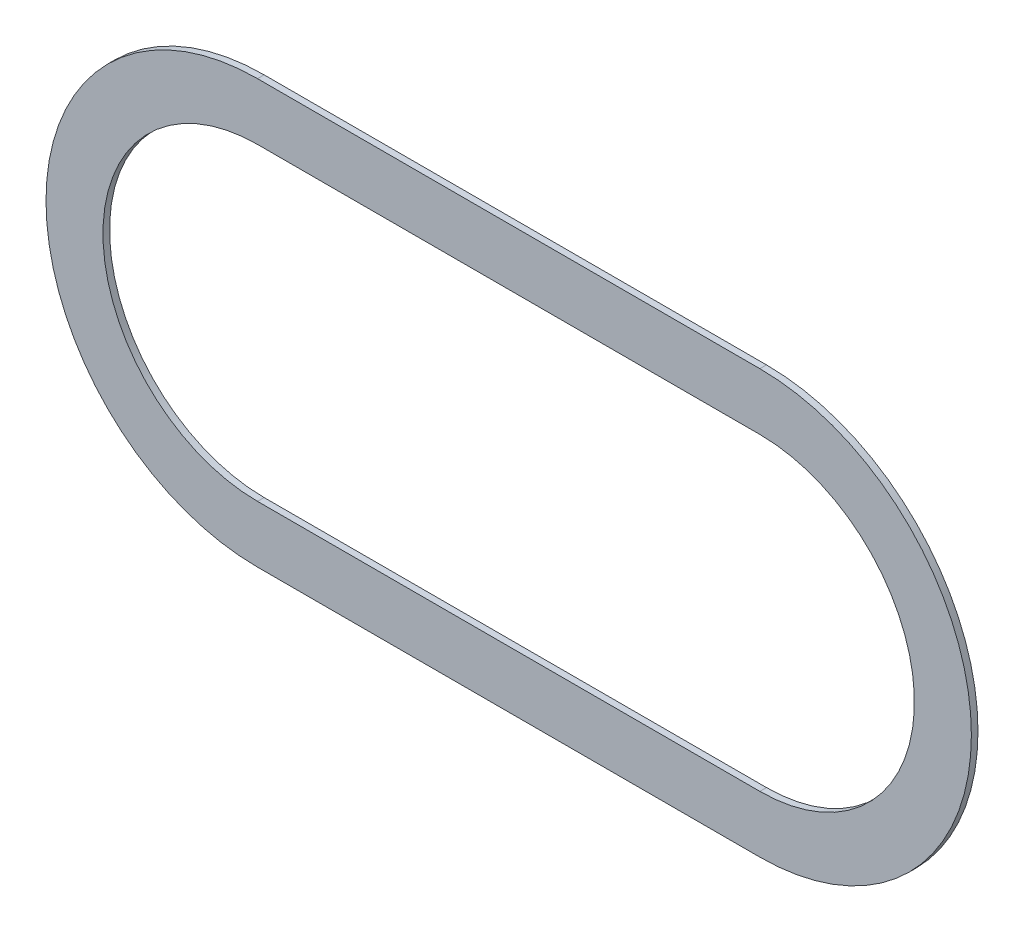
ISO-10303-21;
HEADER;
FILE_DESCRIPTION(('STEP AP214'),'2;1');
FILE_NAME('part.step','',(''),(''),'','','');
FILE_SCHEMA(('AUTOMOTIVE_DESIGN { 1 0 10303 214 1 1 1 1 }'));
ENDSEC;
DATA;
#1=APPLICATION_CONTEXT('core data for automotive mechanical design processes');
#2=APPLICATION_PROTOCOL_DEFINITION('international standard','automotive_design',2000,#1);
#3=PRODUCT_CONTEXT('',#1,'mechanical');
#4=PRODUCT('Part','Part','',(#3));
#5=PRODUCT_RELATED_PRODUCT_CATEGORY('part','',(#4));
#6=PRODUCT_DEFINITION_FORMATION('','',#4);
#7=PRODUCT_DEFINITION_CONTEXT('part definition',#1,'design');
#8=PRODUCT_DEFINITION('design','',#6,#7);
#9=PRODUCT_DEFINITION_SHAPE('','',#8);
#10=(LENGTH_UNIT() NAMED_UNIT(*) SI_UNIT(.MILLI.,.METRE.));
#11=(NAMED_UNIT(*) PLANE_ANGLE_UNIT() SI_UNIT($,.RADIAN.));
#12=(NAMED_UNIT(*) SI_UNIT($,.STERADIAN.) SOLID_ANGLE_UNIT());
#13=UNCERTAINTY_MEASURE_WITH_UNIT(LENGTH_MEASURE(1.E-05),#10,'distance_accuracy_value','');
#14=(GEOMETRIC_REPRESENTATION_CONTEXT(3) GLOBAL_UNCERTAINTY_ASSIGNED_CONTEXT((#13)) GLOBAL_UNIT_ASSIGNED_CONTEXT((#10,
#11,#12)) REPRESENTATION_CONTEXT('',''));
#15=CARTESIAN_POINT('',(0.,0.,0.));
#16=DIRECTION('',(0.,0.,1.));
#17=DIRECTION('',(1.,0.,0.));
#18=AXIS2_PLACEMENT_3D('',#15,#16,#17);
#19=CARTESIAN_POINT('',(17.7700008440297,4.93000023416243,0.));
#20=DIRECTION('',(0.,0.,-1.));
#21=DIRECTION('',(0.,-1.,0.));
#22=AXIS2_PLACEMENT_3D('',#19,#20,#21);
#23=PLANE('',#22);
#24=CARTESIAN_POINT('',(17.9600008530542,4.93000023416243,0.));
#25=DIRECTION('',(0.,0.,1.));
#26=DIRECTION('',(0.,1.,0.));
#27=AXIS2_PLACEMENT_3D('',#24,#25,#26);
#28=CIRCLE('',#27,0.116903674951712);
#29=CARTESIAN_POINT('',(17.9600008530542,4.81309655921072,0.));
#30=VERTEX_POINT('',#29);
#31=CARTESIAN_POINT('',(17.9600008530542,5.04690390911415,0.));
#32=VERTEX_POINT('',#31);
#33=EDGE_CURVE('E136',#30,#32,#28,.T.);
#34=ORIENTED_EDGE('',*,*,#33,.F.);
#35=DIRECTION('',(1.,0.,0.));
#36=VECTOR('',#35,1.);
#37=CARTESIAN_POINT('',(17.9600008530542,4.81309655921072,0.));
#38=LINE('',#37,#36);
#39=CARTESIAN_POINT('',(17.5800008350052,4.81309655921072,0.));
#40=VERTEX_POINT('',#39);
#41=EDGE_CURVE('E193',#40,#30,#38,.T.);
#42=ORIENTED_EDGE('',*,*,#41,.F.);
#43=CARTESIAN_POINT('',(17.5800008350052,4.93000023416243,0.));
#44=DIRECTION('',(0.,0.,1.));
#45=DIRECTION('',(0.,-1.,0.));
#46=AXIS2_PLACEMENT_3D('',#43,#44,#45);
#47=CIRCLE('',#46,0.116903674951712);
#48=CARTESIAN_POINT('',(17.5800008350052,5.04690390911415,0.));
#49=VERTEX_POINT('',#48);
#50=EDGE_CURVE('E124',#49,#40,#47,.T.);
#51=ORIENTED_EDGE('',*,*,#50,.F.);
#52=DIRECTION('',(-1.,0.,0.));
#53=VECTOR('',#52,1.);
#54=CARTESIAN_POINT('',(17.5800008350052,5.04690390911415,0.));
#55=LINE('',#54,#53);
#56=EDGE_CURVE('E156',#32,#49,#55,.T.);
#57=ORIENTED_EDGE('',*,*,#56,.F.);
#58=EDGE_LOOP('',(#34,#42,#51,#57));
#59=FACE_BOUND('',#58,.T.);
#60=CARTESIAN_POINT('',(17.9600008530542,4.93000023416243,0.));
#61=DIRECTION('',(0.,0.,-1.));
#62=DIRECTION('',(0.,1.,0.));
#63=AXIS2_PLACEMENT_3D('',#60,#61,#62);
#64=CIRCLE('',#63,0.160000007599592);
#65=CARTESIAN_POINT('',(17.9600008530542,5.09000024176203,0.));
#66=VERTEX_POINT('',#65);
#67=CARTESIAN_POINT('',(17.9600008530542,4.77000022656284,0.));
#68=VERTEX_POINT('',#67);
#69=EDGE_CURVE('E27',#66,#68,#64,.T.);
#70=ORIENTED_EDGE('',*,*,#69,.F.);
#71=DIRECTION('',(1.,0.,0.));
#72=VECTOR('',#71,1.);
#73=CARTESIAN_POINT('',(17.5800008350052,5.09000024176203,0.));
#74=LINE('',#73,#72);
#75=CARTESIAN_POINT('',(17.5800008350052,5.09000024176203,0.));
#76=VERTEX_POINT('',#75);
#77=EDGE_CURVE('E147',#76,#66,#74,.T.);
#78=ORIENTED_EDGE('',*,*,#77,.F.);
#79=CARTESIAN_POINT('',(17.5800008350052,4.93000023416243,0.));
#80=DIRECTION('',(0.,0.,-1.));
#81=DIRECTION('',(0.,-1.,0.));
#82=AXIS2_PLACEMENT_3D('',#79,#80,#81);
#83=CIRCLE('',#82,0.160000007599592);
#84=CARTESIAN_POINT('',(17.5800008350052,4.77000022656284,0.));
#85=VERTEX_POINT('',#84);
#86=EDGE_CURVE('E80',#85,#76,#83,.T.);
#87=ORIENTED_EDGE('',*,*,#86,.F.);
#88=DIRECTION('',(-1.,0.,0.));
#89=VECTOR('',#88,1.);
#90=CARTESIAN_POINT('',(17.9600008530542,4.77000022656284,0.));
#91=LINE('',#90,#89);
#92=EDGE_CURVE('E106',#68,#85,#91,.T.);
#93=ORIENTED_EDGE('',*,*,#92,.F.);
#94=EDGE_LOOP('',(#70,#78,#87,#93));
#95=FACE_BOUND('',#94,.T.);
#96=ADVANCED_FACE('F17',(#59,#95),#23,.F.);
#97=CARTESIAN_POINT('',(17.7700008440297,4.93000023416243,-0.005));
#98=DIRECTION('',(0.,0.,-1.));
#99=DIRECTION('',(0.,-1.,0.));
#100=AXIS2_PLACEMENT_3D('',#97,#98,#99);
#101=PLANE('',#100);
#102=CARTESIAN_POINT('',(17.9600008530542,4.93000023416243,-0.005));
#103=DIRECTION('',(0.,0.,1.));
#104=DIRECTION('',(0.,1.,0.));
#105=AXIS2_PLACEMENT_3D('',#102,#103,#104);
#106=CIRCLE('',#105,0.116903674951712);
#107=CARTESIAN_POINT('',(17.9600008530542,4.81309655921072,-0.005));
#108=VERTEX_POINT('',#107);
#109=CARTESIAN_POINT('',(17.9600008530542,5.04690390911415,-0.005));
#110=VERTEX_POINT('',#109);
#111=EDGE_CURVE('E138',#108,#110,#106,.T.);
#112=ORIENTED_EDGE('',*,*,#111,.T.);
#113=DIRECTION('',(-1.,0.,0.));
#114=VECTOR('',#113,1.);
#115=CARTESIAN_POINT('',(17.5800008350052,5.04690390911415,-0.005));
#116=LINE('',#115,#114);
#117=CARTESIAN_POINT('',(17.5800008350052,5.04690390911415,-0.005));
#118=VERTEX_POINT('',#117);
#119=EDGE_CURVE('E20',#110,#118,#116,.T.);
#120=ORIENTED_EDGE('',*,*,#119,.T.);
#121=CARTESIAN_POINT('',(17.5800008350052,4.93000023416243,-0.005));
#122=DIRECTION('',(0.,0.,1.));
#123=DIRECTION('',(0.,-1.,0.));
#124=AXIS2_PLACEMENT_3D('',#121,#122,#123);
#125=CIRCLE('',#124,0.116903674951712);
#126=CARTESIAN_POINT('',(17.5800008350052,4.81309655921072,-0.005));
#127=VERTEX_POINT('',#126);
#128=EDGE_CURVE('E165',#118,#127,#125,.T.);
#129=ORIENTED_EDGE('',*,*,#128,.T.);
#130=DIRECTION('',(1.,0.,0.));
#131=VECTOR('',#130,1.);
#132=CARTESIAN_POINT('',(17.9600008530542,4.81309655921072,-0.005));
#133=LINE('',#132,#131);
#134=EDGE_CURVE('E126',#127,#108,#133,.T.);
#135=ORIENTED_EDGE('',*,*,#134,.T.);
#136=EDGE_LOOP('',(#112,#120,#129,#135));
#137=FACE_BOUND('',#136,.T.);
#138=CARTESIAN_POINT('',(17.9600008530542,4.93000023416243,-0.005));
#139=DIRECTION('',(0.,0.,-1.));
#140=DIRECTION('',(0.,1.,0.));
#141=AXIS2_PLACEMENT_3D('',#138,#139,#140);
#142=CIRCLE('',#141,0.160000007599592);
#143=CARTESIAN_POINT('',(17.9600008530542,5.09000024176203,-0.005));
#144=VERTEX_POINT('',#143);
#145=CARTESIAN_POINT('',(17.9600008530542,4.77000022656284,-0.005));
#146=VERTEX_POINT('',#145);
#147=EDGE_CURVE('E11',#144,#146,#142,.T.);
#148=ORIENTED_EDGE('',*,*,#147,.T.);
#149=DIRECTION('',(-1.,0.,0.));
#150=VECTOR('',#149,1.);
#151=CARTESIAN_POINT('',(17.9600008530542,4.77000022656284,-0.005));
#152=LINE('',#151,#150);
#153=CARTESIAN_POINT('',(17.5800008350052,4.77000022656284,-0.005));
#154=VERTEX_POINT('',#153);
#155=EDGE_CURVE('E97',#146,#154,#152,.T.);
#156=ORIENTED_EDGE('',*,*,#155,.T.);
#157=CARTESIAN_POINT('',(17.5800008350052,4.93000023416243,-0.005));
#158=DIRECTION('',(0.,0.,-1.));
#159=DIRECTION('',(0.,-1.,0.));
#160=AXIS2_PLACEMENT_3D('',#157,#158,#159);
#161=CIRCLE('',#160,0.160000007599592);
#162=CARTESIAN_POINT('',(17.5800008350052,5.09000024176203,-0.005));
#163=VERTEX_POINT('',#162);
#164=EDGE_CURVE('E101',#154,#163,#161,.T.);
#165=ORIENTED_EDGE('',*,*,#164,.T.);
#166=DIRECTION('',(1.,0.,0.));
#167=VECTOR('',#166,1.);
#168=CARTESIAN_POINT('',(17.5800008350052,5.09000024176203,-0.005));
#169=LINE('',#168,#167);
#170=EDGE_CURVE('E131',#163,#144,#169,.T.);
#171=ORIENTED_EDGE('',*,*,#170,.T.);
#172=EDGE_LOOP('',(#148,#156,#165,#171));
#173=FACE_BOUND('',#172,.T.);
#174=ADVANCED_FACE('F99',(#137,#173),#101,.T.);
#175=CARTESIAN_POINT('',(17.9600008530542,4.93000023416243,0.));
#176=DIRECTION('',(0.,0.,-1.));
#177=DIRECTION('',(0.,1.,0.));
#178=AXIS2_PLACEMENT_3D('',#175,#176,#177);
#179=CYLINDRICAL_SURFACE('',#178,0.160000007599592);
#180=ORIENTED_EDGE('',*,*,#69,.T.);
#181=DIRECTION('',(0.,0.,-1.));
#182=VECTOR('',#181,1.);
#183=CARTESIAN_POINT('',(17.9600008530542,4.77000022656284,0.));
#184=LINE('',#183,#182);
#185=EDGE_CURVE('E105',#68,#146,#184,.T.);
#186=ORIENTED_EDGE('',*,*,#185,.T.);
#187=ORIENTED_EDGE('',*,*,#147,.F.);
#188=DIRECTION('',(0.,0.,-1.));
#189=VECTOR('',#188,1.);
#190=CARTESIAN_POINT('',(17.9600008530542,5.09000024176203,0.));
#191=LINE('',#190,#189);
#192=EDGE_CURVE('E134',#66,#144,#191,.T.);
#193=ORIENTED_EDGE('',*,*,#192,.F.);
#194=EDGE_LOOP('',(#180,#186,#187,#193));
#195=FACE_BOUND('',#194,.T.);
#196=ADVANCED_FACE('F228',(#195),#179,.T.);
#197=CARTESIAN_POINT('',(17.9600008530542,4.77000022656284,0.));
#198=DIRECTION('',(0.,-1.,0.));
#199=DIRECTION('',(0.,0.,-1.));
#200=AXIS2_PLACEMENT_3D('',#197,#198,#199);
#201=PLANE('',#200);
#202=ORIENTED_EDGE('',*,*,#92,.T.);
#203=DIRECTION('',(0.,0.,-1.));
#204=VECTOR('',#203,1.);
#205=CARTESIAN_POINT('',(17.5800008350052,4.77000022656284,0.));
#206=LINE('',#205,#204);
#207=EDGE_CURVE('E108',#85,#154,#206,.T.);
#208=ORIENTED_EDGE('',*,*,#207,.T.);
#209=ORIENTED_EDGE('',*,*,#155,.F.);
#210=ORIENTED_EDGE('',*,*,#185,.F.);
#211=EDGE_LOOP('',(#202,#208,#209,#210));
#212=FACE_BOUND('',#211,.T.);
#213=ADVANCED_FACE('F109',(#212),#201,.T.);
#214=CARTESIAN_POINT('',(17.5800008350052,4.93000023416243,0.));
#215=DIRECTION('',(0.,0.,-1.));
#216=DIRECTION('',(0.,-1.,0.));
#217=AXIS2_PLACEMENT_3D('',#214,#215,#216);
#218=CYLINDRICAL_SURFACE('',#217,0.160000007599592);
#219=ORIENTED_EDGE('',*,*,#86,.T.);
#220=DIRECTION('',(0.,0.,-1.));
#221=VECTOR('',#220,1.);
#222=CARTESIAN_POINT('',(17.5800008350052,5.09000024176203,0.));
#223=LINE('',#222,#221);
#224=EDGE_CURVE('E113',#76,#163,#223,.T.);
#225=ORIENTED_EDGE('',*,*,#224,.T.);
#226=ORIENTED_EDGE('',*,*,#164,.F.);
#227=ORIENTED_EDGE('',*,*,#207,.F.);
#228=EDGE_LOOP('',(#219,#225,#226,#227));
#229=FACE_BOUND('',#228,.T.);
#230=ADVANCED_FACE('F112',(#229),#218,.T.);
#231=CARTESIAN_POINT('',(17.5800008350052,5.09000024176203,0.));
#232=DIRECTION('',(0.,1.,0.));
#233=DIRECTION('',(1.,0.,0.));
#234=AXIS2_PLACEMENT_3D('',#231,#232,#233);
#235=PLANE('',#234);
#236=ORIENTED_EDGE('',*,*,#77,.T.);
#237=ORIENTED_EDGE('',*,*,#192,.T.);
#238=ORIENTED_EDGE('',*,*,#170,.F.);
#239=ORIENTED_EDGE('',*,*,#224,.F.);
#240=EDGE_LOOP('',(#236,#237,#238,#239));
#241=FACE_BOUND('',#240,.T.);
#242=ADVANCED_FACE('F238',(#241),#235,.T.);
#243=CARTESIAN_POINT('',(17.9600008530542,4.93000023416243,0.));
#244=DIRECTION('',(0.,0.,-1.));
#245=DIRECTION('',(0.,1.,0.));
#246=AXIS2_PLACEMENT_3D('',#243,#244,#245);
#247=CYLINDRICAL_SURFACE('',#246,0.116903674951712);
#248=ORIENTED_EDGE('',*,*,#33,.T.);
#249=DIRECTION('',(0.,0.,-1.));
#250=VECTOR('',#249,1.);
#251=CARTESIAN_POINT('',(17.9600008530542,5.04690390911415,0.));
#252=LINE('',#251,#250);
#253=EDGE_CURVE('E139',#32,#110,#252,.T.);
#254=ORIENTED_EDGE('',*,*,#253,.T.);
#255=ORIENTED_EDGE('',*,*,#111,.F.);
#256=DIRECTION('',(0.,0.,-1.));
#257=VECTOR('',#256,1.);
#258=CARTESIAN_POINT('',(17.9600008530542,4.81309655921072,0.));
#259=LINE('',#258,#257);
#260=EDGE_CURVE('E130',#30,#108,#259,.T.);
#261=ORIENTED_EDGE('',*,*,#260,.F.);
#262=EDGE_LOOP('',(#248,#254,#255,#261));
#263=FACE_BOUND('',#262,.T.);
#264=ADVANCED_FACE('F202',(#263),#247,.F.);
#265=CARTESIAN_POINT('',(17.9600008530542,5.04690390911415,0.));
#266=DIRECTION('',(0.,-1.,0.));
#267=DIRECTION('',(0.,0.,-1.));
#268=AXIS2_PLACEMENT_3D('',#265,#266,#267);
#269=PLANE('',#268);
#270=ORIENTED_EDGE('',*,*,#56,.T.);
#271=DIRECTION('',(0.,0.,-1.));
#272=VECTOR('',#271,1.);
#273=CARTESIAN_POINT('',(17.5800008350052,5.04690390911415,0.));
#274=LINE('',#273,#272);
#275=EDGE_CURVE('E158',#49,#118,#274,.T.);
#276=ORIENTED_EDGE('',*,*,#275,.T.);
#277=ORIENTED_EDGE('',*,*,#119,.F.);
#278=ORIENTED_EDGE('',*,*,#253,.F.);
#279=EDGE_LOOP('',(#270,#276,#277,#278));
#280=FACE_BOUND('',#279,.T.);
#281=ADVANCED_FACE('F221',(#280),#269,.T.);
#282=CARTESIAN_POINT('',(17.5800008350052,4.93000023416243,0.));
#283=DIRECTION('',(0.,0.,-1.));
#284=DIRECTION('',(0.,-1.,0.));
#285=AXIS2_PLACEMENT_3D('',#282,#283,#284);
#286=CYLINDRICAL_SURFACE('',#285,0.116903674951712);
#287=ORIENTED_EDGE('',*,*,#50,.T.);
#288=DIRECTION('',(0.,0.,-1.));
#289=VECTOR('',#288,1.);
#290=CARTESIAN_POINT('',(17.5800008350052,4.81309655921072,0.));
#291=LINE('',#290,#289);
#292=EDGE_CURVE('E129',#40,#127,#291,.T.);
#293=ORIENTED_EDGE('',*,*,#292,.T.);
#294=ORIENTED_EDGE('',*,*,#128,.F.);
#295=ORIENTED_EDGE('',*,*,#275,.F.);
#296=EDGE_LOOP('',(#287,#293,#294,#295));
#297=FACE_BOUND('',#296,.T.);
#298=ADVANCED_FACE('F206',(#297),#286,.F.);
#299=CARTESIAN_POINT('',(17.5800008350052,4.81309655921072,0.));
#300=DIRECTION('',(0.,1.,0.));
#301=DIRECTION('',(1.,0.,0.));
#302=AXIS2_PLACEMENT_3D('',#299,#300,#301);
#303=PLANE('',#302);
#304=ORIENTED_EDGE('',*,*,#41,.T.);
#305=ORIENTED_EDGE('',*,*,#260,.T.);
#306=ORIENTED_EDGE('',*,*,#134,.F.);
#307=ORIENTED_EDGE('',*,*,#292,.F.);
#308=EDGE_LOOP('',(#304,#305,#306,#307));
#309=FACE_BOUND('',#308,.T.);
#310=ADVANCED_FACE('F200',(#309),#303,.T.);
#311=CLOSED_SHELL('',(#96,#174,#196,#213,#230,#242,#264,#281,#298,#310));
#312=MANIFOLD_SOLID_BREP('B1',#311);
#313=ADVANCED_BREP_SHAPE_REPRESENTATION('',(#18,#312),#14);
#314=SHAPE_DEFINITION_REPRESENTATION(#9,#313);
ENDSEC;
END-ISO-10303-21;
